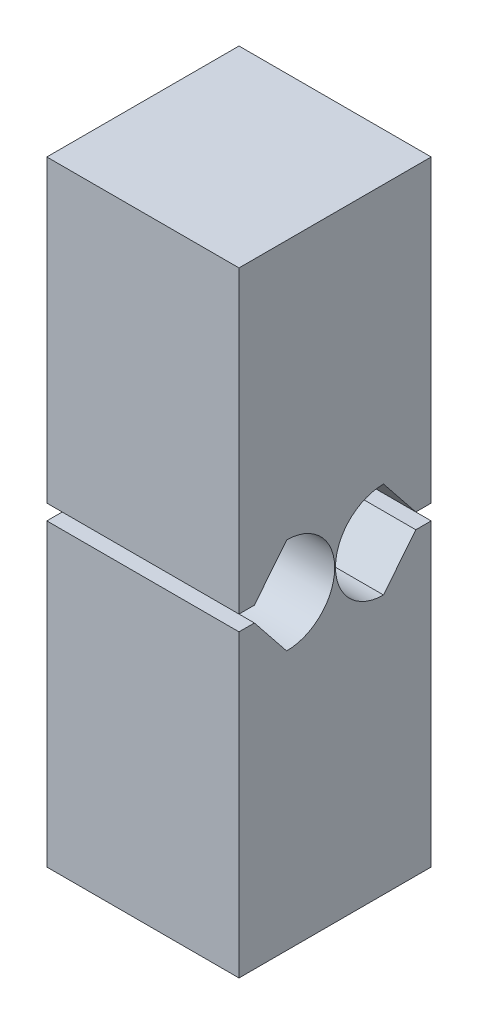
ISO-10303-21;
HEADER;
FILE_DESCRIPTION(('STEP AP214'),'2;1');
FILE_NAME('part.step','',(''),(''),'','','');
FILE_SCHEMA(('AUTOMOTIVE_DESIGN { 1 0 10303 214 1 1 1 1 }'));
ENDSEC;
DATA;
#1=APPLICATION_CONTEXT('core data for automotive mechanical design processes');
#2=APPLICATION_PROTOCOL_DEFINITION('international standard','automotive_design',2000,#1);
#3=PRODUCT_CONTEXT('',#1,'mechanical');
#4=PRODUCT('Part','Part','',(#3));
#5=PRODUCT_RELATED_PRODUCT_CATEGORY('part','',(#4));
#6=PRODUCT_DEFINITION_FORMATION('','',#4);
#7=PRODUCT_DEFINITION_CONTEXT('part definition',#1,'design');
#8=PRODUCT_DEFINITION('design','',#6,#7);
#9=PRODUCT_DEFINITION_SHAPE('','',#8);
#10=(LENGTH_UNIT() NAMED_UNIT(*) SI_UNIT(.MILLI.,.METRE.));
#11=(NAMED_UNIT(*) PLANE_ANGLE_UNIT() SI_UNIT($,.RADIAN.));
#12=(NAMED_UNIT(*) SI_UNIT($,.STERADIAN.) SOLID_ANGLE_UNIT());
#13=UNCERTAINTY_MEASURE_WITH_UNIT(LENGTH_MEASURE(1.E-05),#10,'distance_accuracy_value','');
#14=(GEOMETRIC_REPRESENTATION_CONTEXT(3) GLOBAL_UNCERTAINTY_ASSIGNED_CONTEXT((#13)) GLOBAL_UNIT_ASSIGNED_CONTEXT((#10,
#11,#12)) REPRESENTATION_CONTEXT('',''));
#15=CARTESIAN_POINT('',(0.,0.,0.));
#16=DIRECTION('',(0.,0.,1.));
#17=DIRECTION('',(1.,0.,0.));
#18=AXIS2_PLACEMENT_3D('',#15,#16,#17);
#19=CARTESIAN_POINT('',(-3.175,10.16,-3.175));
#20=DIRECTION('',(1.,0.,0.));
#21=DIRECTION('',(0.,0.,-1.));
#22=AXIS2_PLACEMENT_3D('',#19,#20,#21);
#23=PLANE('',#22);
#24=DIRECTION('',(0.,0.,1.));
#25=VECTOR('',#24,1.);
#26=CARTESIAN_POINT('',(-3.175,0.254,-3.175));
#27=LINE('',#26,#25);
#28=CARTESIAN_POINT('',(-3.175,0.254000000000001,-3.175));
#29=VERTEX_POINT('',#28);
#30=CARTESIAN_POINT('',(-3.175,0.254,-2.667));
#31=VERTEX_POINT('',#30);
#32=EDGE_CURVE('E147',#29,#31,#27,.T.);
#33=ORIENTED_EDGE('',*,*,#32,.T.);
#34=DIRECTION('',(0.,0.78086880944303,0.624695047554424));
#35=VECTOR('',#34,1.);
#36=CARTESIAN_POINT('',(-3.175,0.254,-2.667));
#37=LINE('',#36,#35);
#38=CARTESIAN_POINT('',(-3.175,1.5875,-1.6002));
#39=VERTEX_POINT('',#38);
#40=EDGE_CURVE('E158',#31,#39,#37,.T.);
#41=ORIENTED_EDGE('',*,*,#40,.T.);
#42=CARTESIAN_POINT('',(-3.175,0.,-1.6002));
#43=DIRECTION('',(1.,0.,0.));
#44=DIRECTION('',(0.,0.,-1.));
#45=AXIS2_PLACEMENT_3D('',#42,#43,#44);
#46=CIRCLE('',#45,1.5875);
#47=CARTESIAN_POINT('',(-3.175,-1.5875,-1.6002));
#48=VERTEX_POINT('',#47);
#49=EDGE_CURVE('E282',#39,#48,#46,.T.);
#50=ORIENTED_EDGE('',*,*,#49,.T.);
#51=DIRECTION('',(0.,0.78086880944303,-0.624695047554424));
#52=VECTOR('',#51,1.);
#53=CARTESIAN_POINT('',(-3.175,-0.254,-2.667));
#54=LINE('',#53,#52);
#55=CARTESIAN_POINT('',(-3.175,-0.254,-2.667));
#56=VERTEX_POINT('',#55);
#57=EDGE_CURVE('E259',#48,#56,#54,.T.);
#58=ORIENTED_EDGE('',*,*,#57,.T.);
#59=DIRECTION('',(0.,0.,-1.));
#60=VECTOR('',#59,1.);
#61=CARTESIAN_POINT('',(-3.175,-0.254,-3.175));
#62=LINE('',#61,#60);
#63=CARTESIAN_POINT('',(-3.175,-0.254000000000001,-3.175));
#64=VERTEX_POINT('',#63);
#65=EDGE_CURVE('E285',#56,#64,#62,.T.);
#66=ORIENTED_EDGE('',*,*,#65,.T.);
#67=DIRECTION('',(0.,-1.,0.));
#68=VECTOR('',#67,1.);
#69=CARTESIAN_POINT('',(-3.175,10.16,-3.175));
#70=LINE('',#69,#68);
#71=CARTESIAN_POINT('',(-3.175,-10.16,-3.175));
#72=VERTEX_POINT('',#71);
#73=EDGE_CURVE('E175',#64,#72,#70,.T.);
#74=ORIENTED_EDGE('',*,*,#73,.T.);
#75=DIRECTION('',(0.,0.,1.));
#76=VECTOR('',#75,1.);
#77=CARTESIAN_POINT('',(-3.175,-10.16,-3.175));
#78=LINE('',#77,#76);
#79=CARTESIAN_POINT('',(-3.175,-10.16,3.175));
#80=VERTEX_POINT('',#79);
#81=EDGE_CURVE('E210',#72,#80,#78,.T.);
#82=ORIENTED_EDGE('',*,*,#81,.T.);
#83=DIRECTION('',(0.,-1.,0.));
#84=VECTOR('',#83,1.);
#85=CARTESIAN_POINT('',(-3.175,10.16,3.175));
#86=LINE('',#85,#84);
#87=CARTESIAN_POINT('',(-3.175,-0.254,3.175));
#88=VERTEX_POINT('',#87);
#89=EDGE_CURVE('E42',#88,#80,#86,.T.);
#90=ORIENTED_EDGE('',*,*,#89,.F.);
#91=DIRECTION('',(0.,0.,1.));
#92=VECTOR('',#91,1.);
#93=CARTESIAN_POINT('',(-3.175,-0.254,3.175));
#94=LINE('',#93,#92);
#95=CARTESIAN_POINT('',(-3.175,-0.254,2.667));
#96=VERTEX_POINT('',#95);
#97=EDGE_CURVE('E248',#96,#88,#94,.T.);
#98=ORIENTED_EDGE('',*,*,#97,.F.);
#99=DIRECTION('',(0.,0.78086880944303,0.624695047554424));
#100=VECTOR('',#99,1.);
#101=CARTESIAN_POINT('',(-3.175,-0.254,2.667));
#102=LINE('',#101,#100);
#103=CARTESIAN_POINT('',(-3.175,-1.5875,1.6002));
#104=VERTEX_POINT('',#103);
#105=EDGE_CURVE('E250',#104,#96,#102,.T.);
#106=ORIENTED_EDGE('',*,*,#105,.F.);
#107=CARTESIAN_POINT('',(-3.175,0.,1.6002));
#108=DIRECTION('',(1.,0.,0.));
#109=DIRECTION('',(0.,0.,-1.));
#110=AXIS2_PLACEMENT_3D('',#107,#108,#109);
#111=CIRCLE('',#110,1.5875);
#112=CARTESIAN_POINT('',(-3.175,1.5875,1.6002));
#113=VERTEX_POINT('',#112);
#114=EDGE_CURVE('E253',#113,#104,#111,.F.);
#115=ORIENTED_EDGE('',*,*,#114,.F.);
#116=DIRECTION('',(0.,0.78086880944303,-0.624695047554424));
#117=VECTOR('',#116,1.);
#118=CARTESIAN_POINT('',(-3.175,0.254,2.667));
#119=LINE('',#118,#117);
#120=CARTESIAN_POINT('',(-3.175,0.254,2.667));
#121=VERTEX_POINT('',#120);
#122=EDGE_CURVE('E216',#121,#113,#119,.T.);
#123=ORIENTED_EDGE('',*,*,#122,.F.);
#124=DIRECTION('',(0.,0.,-1.));
#125=VECTOR('',#124,1.);
#126=CARTESIAN_POINT('',(-3.175,0.254,3.175));
#127=LINE('',#126,#125);
#128=CARTESIAN_POINT('',(-3.175,0.254,3.175));
#129=VERTEX_POINT('',#128);
#130=EDGE_CURVE('E256',#129,#121,#127,.T.);
#131=ORIENTED_EDGE('',*,*,#130,.F.);
#132=CARTESIAN_POINT('',(-3.175,10.16,3.175));
#133=VERTEX_POINT('',#132);
#134=EDGE_CURVE('E11',#133,#129,#86,.T.);
#135=ORIENTED_EDGE('',*,*,#134,.F.);
#136=DIRECTION('',(0.,0.,1.));
#137=VECTOR('',#136,1.);
#138=CARTESIAN_POINT('',(-3.175,10.16,-3.175));
#139=LINE('',#138,#137);
#140=CARTESIAN_POINT('',(-3.175,10.16,-3.175));
#141=VERTEX_POINT('',#140);
#142=EDGE_CURVE('E173',#141,#133,#139,.T.);
#143=ORIENTED_EDGE('',*,*,#142,.F.);
#144=EDGE_CURVE('E165',#141,#29,#70,.T.);
#145=ORIENTED_EDGE('',*,*,#144,.T.);
#146=EDGE_LOOP('',(#33,#41,#50,#58,#66,#74,#82,#90,#98,#106,#115,#123,#131,#135,#143,#145));
#147=FACE_BOUND('',#146,.T.);
#148=ADVANCED_FACE('F35',(#147),#23,.F.);
#149=CARTESIAN_POINT('',(3.175,10.16,-3.175));
#150=DIRECTION('',(-1.,0.,0.));
#151=DIRECTION('',(0.,0.,1.));
#152=AXIS2_PLACEMENT_3D('',#149,#150,#151);
#153=PLANE('',#152);
#154=DIRECTION('',(0.,0.,-1.));
#155=VECTOR('',#154,1.);
#156=CARTESIAN_POINT('',(3.175,0.254,-3.175));
#157=LINE('',#156,#155);
#158=CARTESIAN_POINT('',(3.175,0.254,-2.667));
#159=VERTEX_POINT('',#158);
#160=CARTESIAN_POINT('',(3.175,0.254,-3.175));
#161=VERTEX_POINT('',#160);
#162=EDGE_CURVE('E273',#159,#161,#157,.T.);
#163=ORIENTED_EDGE('',*,*,#162,.T.);
#164=DIRECTION('',(0.,-1.,0.));
#165=VECTOR('',#164,1.);
#166=CARTESIAN_POINT('',(3.175,10.16,-3.175));
#167=LINE('',#166,#165);
#168=CARTESIAN_POINT('',(3.175,10.16,-3.175));
#169=VERTEX_POINT('',#168);
#170=EDGE_CURVE('E168',#169,#161,#167,.T.);
#171=ORIENTED_EDGE('',*,*,#170,.F.);
#172=DIRECTION('',(0.,0.,-1.));
#173=VECTOR('',#172,1.);
#174=CARTESIAN_POINT('',(3.175,10.16,-3.175));
#175=LINE('',#174,#173);
#176=CARTESIAN_POINT('',(3.175,10.16,3.175));
#177=VERTEX_POINT('',#176);
#178=EDGE_CURVE('E218',#177,#169,#175,.T.);
#179=ORIENTED_EDGE('',*,*,#178,.F.);
#180=DIRECTION('',(0.,-1.,0.));
#181=VECTOR('',#180,1.);
#182=CARTESIAN_POINT('',(3.175,10.16,3.175));
#183=LINE('',#182,#181);
#184=CARTESIAN_POINT('',(3.175,0.254,3.175));
#185=VERTEX_POINT('',#184);
#186=EDGE_CURVE('E183',#177,#185,#183,.T.);
#187=ORIENTED_EDGE('',*,*,#186,.T.);
#188=DIRECTION('',(0.,0.,1.));
#189=VECTOR('',#188,1.);
#190=CARTESIAN_POINT('',(3.175,0.254,3.175));
#191=LINE('',#190,#189);
#192=CARTESIAN_POINT('',(3.175,0.254,2.667));
#193=VERTEX_POINT('',#192);
#194=EDGE_CURVE('E242',#193,#185,#191,.T.);
#195=ORIENTED_EDGE('',*,*,#194,.F.);
#196=DIRECTION('',(0.,-0.78086880944303,0.624695047554424));
#197=VECTOR('',#196,1.);
#198=CARTESIAN_POINT('',(3.175,0.254,2.667));
#199=LINE('',#198,#197);
#200=CARTESIAN_POINT('',(3.175,1.5875,1.6002));
#201=VERTEX_POINT('',#200);
#202=EDGE_CURVE('E244',#201,#193,#199,.T.);
#203=ORIENTED_EDGE('',*,*,#202,.F.);
#204=CARTESIAN_POINT('',(3.175,0.,1.6002));
#205=DIRECTION('',(1.,0.,0.));
#206=DIRECTION('',(0.,0.,1.));
#207=AXIS2_PLACEMENT_3D('',#204,#205,#206);
#208=CIRCLE('',#207,1.5875);
#209=CARTESIAN_POINT('',(3.175,-1.5875,1.6002));
#210=VERTEX_POINT('',#209);
#211=EDGE_CURVE('E57',#210,#201,#208,.T.);
#212=ORIENTED_EDGE('',*,*,#211,.F.);
#213=DIRECTION('',(0.,-0.78086880944303,-0.624695047554424));
#214=VECTOR('',#213,1.);
#215=CARTESIAN_POINT('',(3.175,-0.254,2.667));
#216=LINE('',#215,#214);
#217=CARTESIAN_POINT('',(3.175,-0.254,2.667));
#218=VERTEX_POINT('',#217);
#219=EDGE_CURVE('E229',#218,#210,#216,.T.);
#220=ORIENTED_EDGE('',*,*,#219,.F.);
#221=DIRECTION('',(0.,0.,-1.));
#222=VECTOR('',#221,1.);
#223=CARTESIAN_POINT('',(3.175,-0.254,3.175));
#224=LINE('',#223,#222);
#225=CARTESIAN_POINT('',(3.175,-0.254,3.175));
#226=VERTEX_POINT('',#225);
#227=EDGE_CURVE('E200',#226,#218,#224,.T.);
#228=ORIENTED_EDGE('',*,*,#227,.F.);
#229=CARTESIAN_POINT('',(3.175,-10.16,3.175));
#230=VERTEX_POINT('',#229);
#231=EDGE_CURVE('E182',#226,#230,#183,.T.);
#232=ORIENTED_EDGE('',*,*,#231,.T.);
#233=DIRECTION('',(0.,0.,-1.));
#234=VECTOR('',#233,1.);
#235=CARTESIAN_POINT('',(3.175,-10.16,-3.175));
#236=LINE('',#235,#234);
#237=CARTESIAN_POINT('',(3.175,-10.16,-3.175));
#238=VERTEX_POINT('',#237);
#239=EDGE_CURVE('E196',#230,#238,#236,.T.);
#240=ORIENTED_EDGE('',*,*,#239,.T.);
#241=CARTESIAN_POINT('',(3.175,-0.254000000000001,-3.175));
#242=VERTEX_POINT('',#241);
#243=EDGE_CURVE('E174',#242,#238,#167,.T.);
#244=ORIENTED_EDGE('',*,*,#243,.F.);
#245=DIRECTION('',(0.,0.,1.));
#246=VECTOR('',#245,1.);
#247=CARTESIAN_POINT('',(3.175,-0.254,-3.175));
#248=LINE('',#247,#246);
#249=CARTESIAN_POINT('',(3.175,-0.254,-2.667));
#250=VERTEX_POINT('',#249);
#251=EDGE_CURVE('E49',#242,#250,#248,.T.);
#252=ORIENTED_EDGE('',*,*,#251,.T.);
#253=DIRECTION('',(0.,-0.78086880944303,0.624695047554424));
#254=VECTOR('',#253,1.);
#255=CARTESIAN_POINT('',(3.175,-0.254,-2.667));
#256=LINE('',#255,#254);
#257=CARTESIAN_POINT('',(3.175,-1.5875,-1.6002));
#258=VERTEX_POINT('',#257);
#259=EDGE_CURVE('E276',#250,#258,#256,.T.);
#260=ORIENTED_EDGE('',*,*,#259,.T.);
#261=CARTESIAN_POINT('',(3.175,0.,-1.6002));
#262=DIRECTION('',(-1.,0.,0.));
#263=DIRECTION('',(0.,0.,-1.));
#264=AXIS2_PLACEMENT_3D('',#261,#262,#263);
#265=CIRCLE('',#264,1.5875);
#266=CARTESIAN_POINT('',(3.175,1.5875,-1.6002));
#267=VERTEX_POINT('',#266);
#268=EDGE_CURVE('E157',#258,#267,#265,.T.);
#269=ORIENTED_EDGE('',*,*,#268,.T.);
#270=DIRECTION('',(0.,-0.78086880944303,-0.624695047554424));
#271=VECTOR('',#270,1.);
#272=CARTESIAN_POINT('',(3.175,0.254,-2.667));
#273=LINE('',#272,#271);
#274=EDGE_CURVE('E266',#267,#159,#273,.T.);
#275=ORIENTED_EDGE('',*,*,#274,.T.);
#276=EDGE_LOOP('',(#163,#171,#179,#187,#195,#203,#212,#220,#228,#232,#240,#244,#252,#260,#269,#275));
#277=FACE_BOUND('',#276,.T.);
#278=ADVANCED_FACE('F193',(#277),#153,.F.);
#279=CARTESIAN_POINT('',(-3.175,10.16,-3.175));
#280=DIRECTION('',(0.,0.,1.));
#281=DIRECTION('',(1.,0.,0.));
#282=AXIS2_PLACEMENT_3D('',#279,#280,#281);
#283=PLANE('',#282);
#284=DIRECTION('',(1.,0.,0.));
#285=VECTOR('',#284,1.);
#286=CARTESIAN_POINT('',(-3.176,0.254,-3.175));
#287=LINE('',#286,#285);
#288=EDGE_CURVE('E151',#29,#161,#287,.T.);
#289=ORIENTED_EDGE('',*,*,#288,.F.);
#290=ORIENTED_EDGE('',*,*,#144,.F.);
#291=DIRECTION('',(-1.,0.,0.));
#292=VECTOR('',#291,1.);
#293=CARTESIAN_POINT('',(-3.175,10.16,-3.175));
#294=LINE('',#293,#292);
#295=EDGE_CURVE('E178',#169,#141,#294,.T.);
#296=ORIENTED_EDGE('',*,*,#295,.F.);
#297=ORIENTED_EDGE('',*,*,#170,.T.);
#298=EDGE_LOOP('',(#289,#290,#296,#297));
#299=FACE_BOUND('',#298,.T.);
#300=ADVANCED_FACE('F163',(#299),#283,.F.);
#301=DIRECTION('',(1.,0.,0.));
#302=VECTOR('',#301,1.);
#303=CARTESIAN_POINT('',(-3.176,-0.254,-3.175));
#304=LINE('',#303,#302);
#305=EDGE_CURVE('E169',#64,#242,#304,.T.);
#306=ORIENTED_EDGE('',*,*,#305,.T.);
#307=ORIENTED_EDGE('',*,*,#243,.T.);
#308=DIRECTION('',(-1.,0.,0.));
#309=VECTOR('',#308,1.);
#310=CARTESIAN_POINT('',(-3.175,-10.16,-3.175));
#311=LINE('',#310,#309);
#312=EDGE_CURVE('E180',#238,#72,#311,.T.);
#313=ORIENTED_EDGE('',*,*,#312,.T.);
#314=ORIENTED_EDGE('',*,*,#73,.F.);
#315=EDGE_LOOP('',(#306,#307,#313,#314));
#316=FACE_BOUND('',#315,.T.);
#317=ADVANCED_FACE('F290',(#316),#283,.F.);
#318=CARTESIAN_POINT('',(-3.175,10.16,3.175));
#319=DIRECTION('',(0.,0.,-1.));
#320=DIRECTION('',(-1.,0.,0.));
#321=AXIS2_PLACEMENT_3D('',#318,#319,#320);
#322=PLANE('',#321);
#323=ORIENTED_EDGE('',*,*,#231,.F.);
#324=DIRECTION('',(1.,0.,0.));
#325=VECTOR('',#324,1.);
#326=CARTESIAN_POINT('',(-3.176,-0.254,3.175));
#327=LINE('',#326,#325);
#328=EDGE_CURVE('E234',#88,#226,#327,.T.);
#329=ORIENTED_EDGE('',*,*,#328,.F.);
#330=ORIENTED_EDGE('',*,*,#89,.T.);
#331=DIRECTION('',(1.,0.,0.));
#332=VECTOR('',#331,1.);
#333=CARTESIAN_POINT('',(-3.175,-10.16,3.175));
#334=LINE('',#333,#332);
#335=EDGE_CURVE('E204',#80,#230,#334,.T.);
#336=ORIENTED_EDGE('',*,*,#335,.T.);
#337=EDGE_LOOP('',(#323,#329,#330,#336));
#338=FACE_BOUND('',#337,.T.);
#339=ADVANCED_FACE('F205',(#338),#322,.F.);
#340=ORIENTED_EDGE('',*,*,#134,.T.);
#341=DIRECTION('',(1.,0.,0.));
#342=VECTOR('',#341,1.);
#343=CARTESIAN_POINT('',(-3.176,0.254,3.175));
#344=LINE('',#343,#342);
#345=EDGE_CURVE('E231',#129,#185,#344,.T.);
#346=ORIENTED_EDGE('',*,*,#345,.T.);
#347=ORIENTED_EDGE('',*,*,#186,.F.);
#348=DIRECTION('',(1.,0.,0.));
#349=VECTOR('',#348,1.);
#350=CARTESIAN_POINT('',(-3.175,10.16,3.175));
#351=LINE('',#350,#349);
#352=EDGE_CURVE('E220',#133,#177,#351,.T.);
#353=ORIENTED_EDGE('',*,*,#352,.F.);
#354=EDGE_LOOP('',(#340,#346,#347,#353));
#355=FACE_BOUND('',#354,.T.);
#356=ADVANCED_FACE('F307',(#355),#322,.F.);
#357=CARTESIAN_POINT('',(0.,10.16,0.));
#358=DIRECTION('',(0.,1.,0.));
#359=DIRECTION('',(0.,0.,1.));
#360=AXIS2_PLACEMENT_3D('',#357,#358,#359);
#361=PLANE('',#360);
#362=ORIENTED_EDGE('',*,*,#142,.T.);
#363=ORIENTED_EDGE('',*,*,#352,.T.);
#364=ORIENTED_EDGE('',*,*,#178,.T.);
#365=ORIENTED_EDGE('',*,*,#295,.T.);
#366=EDGE_LOOP('',(#362,#363,#364,#365));
#367=FACE_BOUND('',#366,.T.);
#368=ADVANCED_FACE('F309',(#367),#361,.T.);
#369=CARTESIAN_POINT('',(0.,-10.16,0.));
#370=DIRECTION('',(0.,1.,0.));
#371=DIRECTION('',(0.,0.,1.));
#372=AXIS2_PLACEMENT_3D('',#369,#370,#371);
#373=PLANE('',#372);
#374=ORIENTED_EDGE('',*,*,#81,.F.);
#375=ORIENTED_EDGE('',*,*,#312,.F.);
#376=ORIENTED_EDGE('',*,*,#239,.F.);
#377=ORIENTED_EDGE('',*,*,#335,.F.);
#378=EDGE_LOOP('',(#374,#375,#376,#377));
#379=FACE_BOUND('',#378,.T.);
#380=ADVANCED_FACE('F212',(#379),#373,.F.);
#381=CARTESIAN_POINT('',(-3.176,0.,1.6002));
#382=DIRECTION('',(1.,0.,0.));
#383=DIRECTION('',(0.,0.,-1.));
#384=AXIS2_PLACEMENT_3D('',#381,#382,#383);
#385=CYLINDRICAL_SURFACE('',#384,1.5875);
#386=ORIENTED_EDGE('',*,*,#114,.T.);
#387=DIRECTION('',(1.,0.,0.));
#388=VECTOR('',#387,1.);
#389=CARTESIAN_POINT('',(-3.176,-1.5875,1.6002));
#390=LINE('',#389,#388);
#391=EDGE_CURVE('E225',#104,#210,#390,.T.);
#392=ORIENTED_EDGE('',*,*,#391,.T.);
#393=ORIENTED_EDGE('',*,*,#211,.T.);
#394=DIRECTION('',(1.,0.,0.));
#395=VECTOR('',#394,1.);
#396=CARTESIAN_POINT('',(-3.176,1.5875,1.6002));
#397=LINE('',#396,#395);
#398=EDGE_CURVE('E226',#113,#201,#397,.T.);
#399=ORIENTED_EDGE('',*,*,#398,.F.);
#400=EDGE_LOOP('',(#386,#392,#393,#399));
#401=FACE_BOUND('',#400,.T.);
#402=ADVANCED_FACE('F298',(#401),#385,.F.);
#403=CARTESIAN_POINT('',(-3.176,-0.254,2.667));
#404=DIRECTION('',(0.,-0.624695047554424,0.78086880944303));
#405=DIRECTION('',(0.,-0.78086880944303,-0.624695047554424));
#406=AXIS2_PLACEMENT_3D('',#403,#404,#405);
#407=PLANE('',#406);
#408=ORIENTED_EDGE('',*,*,#105,.T.);
#409=DIRECTION('',(1.,0.,0.));
#410=VECTOR('',#409,1.);
#411=CARTESIAN_POINT('',(-3.176,-0.254,2.667));
#412=LINE('',#411,#410);
#413=EDGE_CURVE('E236',#96,#218,#412,.T.);
#414=ORIENTED_EDGE('',*,*,#413,.T.);
#415=ORIENTED_EDGE('',*,*,#219,.T.);
#416=ORIENTED_EDGE('',*,*,#391,.F.);
#417=EDGE_LOOP('',(#408,#414,#415,#416));
#418=FACE_BOUND('',#417,.T.);
#419=ADVANCED_FACE('F297',(#418),#407,.F.);
#420=CARTESIAN_POINT('',(-3.176,-0.254,3.175));
#421=DIRECTION('',(0.,-1.,0.));
#422=DIRECTION('',(0.,0.,-1.));
#423=AXIS2_PLACEMENT_3D('',#420,#421,#422);
#424=PLANE('',#423);
#425=ORIENTED_EDGE('',*,*,#97,.T.);
#426=ORIENTED_EDGE('',*,*,#328,.T.);
#427=ORIENTED_EDGE('',*,*,#227,.T.);
#428=ORIENTED_EDGE('',*,*,#413,.F.);
#429=EDGE_LOOP('',(#425,#426,#427,#428));
#430=FACE_BOUND('',#429,.T.);
#431=ADVANCED_FACE('F295',(#430),#424,.F.);
#432=CARTESIAN_POINT('',(-3.176,0.254,3.175));
#433=DIRECTION('',(0.,1.,0.));
#434=DIRECTION('',(0.,0.,1.));
#435=AXIS2_PLACEMENT_3D('',#432,#433,#434);
#436=PLANE('',#435);
#437=ORIENTED_EDGE('',*,*,#130,.T.);
#438=DIRECTION('',(1.,0.,0.));
#439=VECTOR('',#438,1.);
#440=CARTESIAN_POINT('',(-3.176,0.254,2.667));
#441=LINE('',#440,#439);
#442=EDGE_CURVE('E228',#121,#193,#441,.T.);
#443=ORIENTED_EDGE('',*,*,#442,.T.);
#444=ORIENTED_EDGE('',*,*,#194,.T.);
#445=ORIENTED_EDGE('',*,*,#345,.F.);
#446=EDGE_LOOP('',(#437,#443,#444,#445));
#447=FACE_BOUND('',#446,.T.);
#448=ADVANCED_FACE('F305',(#447),#436,.F.);
#449=CARTESIAN_POINT('',(-3.176,0.254,2.667));
#450=DIRECTION('',(0.,0.624695047554424,0.78086880944303));
#451=DIRECTION('',(0.,-0.78086880944303,0.624695047554424));
#452=AXIS2_PLACEMENT_3D('',#449,#450,#451);
#453=PLANE('',#452);
#454=ORIENTED_EDGE('',*,*,#122,.T.);
#455=ORIENTED_EDGE('',*,*,#398,.T.);
#456=ORIENTED_EDGE('',*,*,#202,.T.);
#457=ORIENTED_EDGE('',*,*,#442,.F.);
#458=EDGE_LOOP('',(#454,#455,#456,#457));
#459=FACE_BOUND('',#458,.T.);
#460=ADVANCED_FACE('F302',(#459),#453,.F.);
#461=CARTESIAN_POINT('',(-3.176,0.,-1.6002));
#462=DIRECTION('',(1.,0.,0.));
#463=DIRECTION('',(0.,0.,-1.));
#464=AXIS2_PLACEMENT_3D('',#461,#462,#463);
#465=CYLINDRICAL_SURFACE('',#464,1.5875);
#466=DIRECTION('',(1.,0.,0.));
#467=VECTOR('',#466,1.);
#468=CARTESIAN_POINT('',(-3.176,1.5875,-1.6002));
#469=LINE('',#468,#467);
#470=EDGE_CURVE('E262',#39,#267,#469,.T.);
#471=ORIENTED_EDGE('',*,*,#470,.T.);
#472=ORIENTED_EDGE('',*,*,#268,.F.);
#473=DIRECTION('',(1.,0.,0.));
#474=VECTOR('',#473,1.);
#475=CARTESIAN_POINT('',(-3.176,-1.5875,-1.6002));
#476=LINE('',#475,#474);
#477=EDGE_CURVE('E263',#48,#258,#476,.T.);
#478=ORIENTED_EDGE('',*,*,#477,.F.);
#479=ORIENTED_EDGE('',*,*,#49,.F.);
#480=EDGE_LOOP('',(#471,#472,#478,#479));
#481=FACE_BOUND('',#480,.T.);
#482=ADVANCED_FACE('F317',(#481),#465,.F.);
#483=CARTESIAN_POINT('',(-3.176,0.254,-2.667));
#484=DIRECTION('',(0.,-0.624695047554424,0.78086880944303));
#485=DIRECTION('',(0.,-0.78086880944303,-0.624695047554424));
#486=AXIS2_PLACEMENT_3D('',#483,#484,#485);
#487=PLANE('',#486);
#488=DIRECTION('',(1.,0.,0.));
#489=VECTOR('',#488,1.);
#490=CARTESIAN_POINT('',(-3.176,0.254,-2.667));
#491=LINE('',#490,#489);
#492=EDGE_CURVE('E153',#31,#159,#491,.T.);
#493=ORIENTED_EDGE('',*,*,#492,.T.);
#494=ORIENTED_EDGE('',*,*,#274,.F.);
#495=ORIENTED_EDGE('',*,*,#470,.F.);
#496=ORIENTED_EDGE('',*,*,#40,.F.);
#497=EDGE_LOOP('',(#493,#494,#495,#496));
#498=FACE_BOUND('',#497,.T.);
#499=ADVANCED_FACE('F314',(#498),#487,.T.);
#500=CARTESIAN_POINT('',(-3.176,0.254,-3.175));
#501=DIRECTION('',(0.,-1.,0.));
#502=DIRECTION('',(0.,0.,-1.));
#503=AXIS2_PLACEMENT_3D('',#500,#501,#502);
#504=PLANE('',#503);
#505=ORIENTED_EDGE('',*,*,#288,.T.);
#506=ORIENTED_EDGE('',*,*,#162,.F.);
#507=ORIENTED_EDGE('',*,*,#492,.F.);
#508=ORIENTED_EDGE('',*,*,#32,.F.);
#509=EDGE_LOOP('',(#505,#506,#507,#508));
#510=FACE_BOUND('',#509,.T.);
#511=ADVANCED_FACE('F149',(#510),#504,.T.);
#512=CARTESIAN_POINT('',(-3.176,-0.254,-3.175));
#513=DIRECTION('',(0.,1.,0.));
#514=DIRECTION('',(0.,0.,1.));
#515=AXIS2_PLACEMENT_3D('',#512,#513,#514);
#516=PLANE('',#515);
#517=DIRECTION('',(1.,0.,0.));
#518=VECTOR('',#517,1.);
#519=CARTESIAN_POINT('',(-3.176,-0.254,-2.667));
#520=LINE('',#519,#518);
#521=EDGE_CURVE('E265',#56,#250,#520,.T.);
#522=ORIENTED_EDGE('',*,*,#521,.T.);
#523=ORIENTED_EDGE('',*,*,#251,.F.);
#524=ORIENTED_EDGE('',*,*,#305,.F.);
#525=ORIENTED_EDGE('',*,*,#65,.F.);
#526=EDGE_LOOP('',(#522,#523,#524,#525));
#527=FACE_BOUND('',#526,.T.);
#528=ADVANCED_FACE('F321',(#527),#516,.T.);
#529=CARTESIAN_POINT('',(-3.176,-0.254,-2.667));
#530=DIRECTION('',(0.,0.624695047554424,0.78086880944303));
#531=DIRECTION('',(0.,-0.78086880944303,0.624695047554424));
#532=AXIS2_PLACEMENT_3D('',#529,#530,#531);
#533=PLANE('',#532);
#534=ORIENTED_EDGE('',*,*,#477,.T.);
#535=ORIENTED_EDGE('',*,*,#259,.F.);
#536=ORIENTED_EDGE('',*,*,#521,.F.);
#537=ORIENTED_EDGE('',*,*,#57,.F.);
#538=EDGE_LOOP('',(#534,#535,#536,#537));
#539=FACE_BOUND('',#538,.T.);
#540=ADVANCED_FACE('F320',(#539),#533,.T.);
#541=CLOSED_SHELL('',(#148,#278,#300,#317,#339,#356,#368,#380,#402,#419,#431,#448,#460,#482,
#499,#511,#528,#540));
#542=MANIFOLD_SOLID_BREP('B2',#541);
#543=ADVANCED_BREP_SHAPE_REPRESENTATION('',(#18,#542),#14);
#544=SHAPE_DEFINITION_REPRESENTATION(#9,#543);
ENDSEC;
END-ISO-10303-21;
